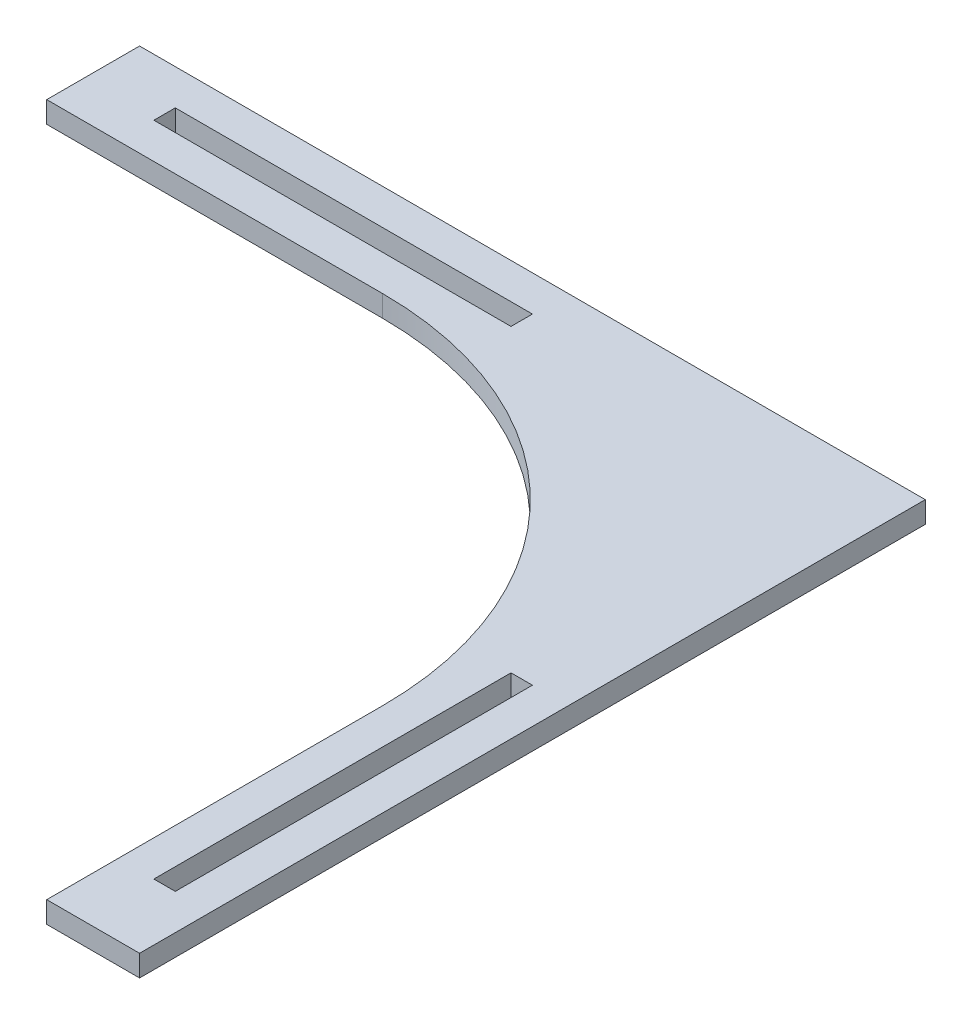
ISO-10303-21;
HEADER;
FILE_DESCRIPTION(('STEP AP214'),'2;1');
FILE_NAME('part.step','',(''),(''),'','','');
FILE_SCHEMA(('AUTOMOTIVE_DESIGN { 1 0 10303 214 1 1 1 1 }'));
ENDSEC;
DATA;
#1=APPLICATION_CONTEXT('core data for automotive mechanical design processes');
#2=APPLICATION_PROTOCOL_DEFINITION('international standard','automotive_design',2000,#1);
#3=PRODUCT_CONTEXT('',#1,'mechanical');
#4=PRODUCT('Part','Part','',(#3));
#5=PRODUCT_RELATED_PRODUCT_CATEGORY('part','',(#4));
#6=PRODUCT_DEFINITION_FORMATION('','',#4);
#7=PRODUCT_DEFINITION_CONTEXT('part definition',#1,'design');
#8=PRODUCT_DEFINITION('design','',#6,#7);
#9=PRODUCT_DEFINITION_SHAPE('','',#8);
#10=(LENGTH_UNIT() NAMED_UNIT(*) SI_UNIT(.MILLI.,.METRE.));
#11=(NAMED_UNIT(*) PLANE_ANGLE_UNIT() SI_UNIT($,.RADIAN.));
#12=(NAMED_UNIT(*) SI_UNIT($,.STERADIAN.) SOLID_ANGLE_UNIT());
#13=UNCERTAINTY_MEASURE_WITH_UNIT(LENGTH_MEASURE(1.E-05),#10,'distance_accuracy_value','');
#14=(GEOMETRIC_REPRESENTATION_CONTEXT(3) GLOBAL_UNCERTAINTY_ASSIGNED_CONTEXT((#13)) GLOBAL_UNIT_ASSIGNED_CONTEXT((#10,
#11,#12)) REPRESENTATION_CONTEXT('',''));
#15=CARTESIAN_POINT('',(0.,0.,0.));
#16=DIRECTION('',(0.,0.,1.));
#17=DIRECTION('',(1.,0.,0.));
#18=AXIS2_PLACEMENT_3D('',#15,#16,#17);
#19=CARTESIAN_POINT('',(-7.99999999999999,3.,8.00000000000001));
#20=DIRECTION('',(0.,-1.,0.));
#21=DIRECTION('',(0.,0.,-1.));
#22=AXIS2_PLACEMENT_3D('',#19,#20,#21);
#23=PLANE('',#22);
#24=DIRECTION('',(0.,0.,1.));
#25=VECTOR('',#24,1.);
#26=CARTESIAN_POINT('',(-45.,3.,-50.));
#27=LINE('',#26,#25);
#28=CARTESIAN_POINT('',(-45.,3.,-50.));
#29=VERTEX_POINT('',#28);
#30=CARTESIAN_POINT('',(-45.,3.,-47.));
#31=VERTEX_POINT('',#30);
#32=EDGE_CURVE('E176',#29,#31,#27,.T.);
#33=ORIENTED_EDGE('',*,*,#32,.F.);
#34=DIRECTION('',(-1.,0.,0.));
#35=VECTOR('',#34,1.);
#36=CARTESIAN_POINT('',(5.00000000000001,3.,-50.));
#37=LINE('',#36,#35);
#38=CARTESIAN_POINT('',(5.00000000000001,3.,-50.));
#39=VERTEX_POINT('',#38);
#40=EDGE_CURVE('E184',#39,#29,#37,.T.);
#41=ORIENTED_EDGE('',*,*,#40,.F.);
#42=DIRECTION('',(0.,0.,-1.));
#43=VECTOR('',#42,1.);
#44=CARTESIAN_POINT('',(5.00000000000001,3.,-47.));
#45=LINE('',#44,#43);
#46=CARTESIAN_POINT('',(5.00000000000001,3.,-47.));
#47=VERTEX_POINT('',#46);
#48=EDGE_CURVE('E181',#47,#39,#45,.T.);
#49=ORIENTED_EDGE('',*,*,#48,.F.);
#50=DIRECTION('',(1.,0.,0.));
#51=VECTOR('',#50,1.);
#52=CARTESIAN_POINT('',(-45.,3.,-47.));
#53=LINE('',#52,#51);
#54=EDGE_CURVE('E178',#31,#47,#53,.T.);
#55=ORIENTED_EDGE('',*,*,#54,.F.);
#56=EDGE_LOOP('',(#33,#41,#49,#55));
#57=FACE_BOUND('',#56,.T.);
#58=DIRECTION('',(0.,0.,-1.));
#59=VECTOR('',#58,1.);
#60=CARTESIAN_POINT('',(55.,3.,-55.));
#61=LINE('',#60,#59);
#62=CARTESIAN_POINT('',(55.,3.,55.));
#63=VERTEX_POINT('',#62);
#64=CARTESIAN_POINT('',(55.,3.,-55.));
#65=VERTEX_POINT('',#64);
#66=EDGE_CURVE('E207',#63,#65,#61,.T.);
#67=ORIENTED_EDGE('',*,*,#66,.T.);
#68=DIRECTION('',(-1.,0.,0.));
#69=VECTOR('',#68,1.);
#70=CARTESIAN_POINT('',(-55.,3.,-55.));
#71=LINE('',#70,#69);
#72=CARTESIAN_POINT('',(-55.,3.,-55.));
#73=VERTEX_POINT('',#72);
#74=EDGE_CURVE('E210',#65,#73,#71,.T.);
#75=ORIENTED_EDGE('',*,*,#74,.T.);
#76=DIRECTION('',(0.,0.,1.));
#77=VECTOR('',#76,1.);
#78=CARTESIAN_POINT('',(-55.,3.,-55.));
#79=LINE('',#78,#77);
#80=CARTESIAN_POINT('',(-55.,3.,-42.));
#81=VERTEX_POINT('',#80);
#82=EDGE_CURVE('E213',#73,#81,#79,.T.);
#83=ORIENTED_EDGE('',*,*,#82,.T.);
#84=DIRECTION('',(1.,0.,0.));
#85=VECTOR('',#84,1.);
#86=CARTESIAN_POINT('',(-55.,3.,-42.));
#87=LINE('',#86,#85);
#88=CARTESIAN_POINT('',(-8.00000000000034,3.,-42.));
#89=VERTEX_POINT('',#88);
#90=EDGE_CURVE('E215',#81,#89,#87,.T.);
#91=ORIENTED_EDGE('',*,*,#90,.T.);
#92=CARTESIAN_POINT('',(-7.99999999999999,3.,8.00000000000001));
#93=DIRECTION('',(0.,-1.,0.));
#94=DIRECTION('',(0.,0.,-1.));
#95=AXIS2_PLACEMENT_3D('',#92,#93,#94);
#96=CIRCLE('',#95,50.);
#97=CARTESIAN_POINT('',(42.,3.,8.00000000000035));
#98=VERTEX_POINT('',#97);
#99=EDGE_CURVE('E217',#89,#98,#96,.T.);
#100=ORIENTED_EDGE('',*,*,#99,.T.);
#101=DIRECTION('',(0.,0.,1.));
#102=VECTOR('',#101,1.);
#103=CARTESIAN_POINT('',(42.,3.,8.00000000000035));
#104=LINE('',#103,#102);
#105=CARTESIAN_POINT('',(42.,3.,55.));
#106=VERTEX_POINT('',#105);
#107=EDGE_CURVE('E219',#98,#106,#104,.T.);
#108=ORIENTED_EDGE('',*,*,#107,.T.);
#109=DIRECTION('',(1.,0.,0.));
#110=VECTOR('',#109,1.);
#111=CARTESIAN_POINT('',(42.,3.,55.));
#112=LINE('',#111,#110);
#113=EDGE_CURVE('E221',#106,#63,#112,.T.);
#114=ORIENTED_EDGE('',*,*,#113,.T.);
#115=EDGE_LOOP('',(#67,#75,#83,#91,#100,#108,#114));
#116=FACE_BOUND('',#115,.T.);
#117=DIRECTION('',(0.,0.,-1.));
#118=VECTOR('',#117,1.);
#119=CARTESIAN_POINT('',(50.,3.,45.));
#120=LINE('',#119,#118);
#121=CARTESIAN_POINT('',(50.,3.,45.));
#122=VERTEX_POINT('',#121);
#123=CARTESIAN_POINT('',(50.,3.,-4.99999999999998));
#124=VERTEX_POINT('',#123);
#125=EDGE_CURVE('E140',#122,#124,#120,.T.);
#126=ORIENTED_EDGE('',*,*,#125,.F.);
#127=DIRECTION('',(1.,0.,0.));
#128=VECTOR('',#127,1.);
#129=CARTESIAN_POINT('',(47.,3.,45.));
#130=LINE('',#129,#128);
#131=CARTESIAN_POINT('',(47.,3.,45.));
#132=VERTEX_POINT('',#131);
#133=EDGE_CURVE('E162',#132,#122,#130,.T.);
#134=ORIENTED_EDGE('',*,*,#133,.F.);
#135=DIRECTION('',(0.,0.,1.));
#136=VECTOR('',#135,1.);
#137=CARTESIAN_POINT('',(47.,3.,-4.99999999999998));
#138=LINE('',#137,#136);
#139=CARTESIAN_POINT('',(47.,3.,-4.99999999999998));
#140=VERTEX_POINT('',#139);
#141=EDGE_CURVE('E160',#140,#132,#138,.T.);
#142=ORIENTED_EDGE('',*,*,#141,.F.);
#143=DIRECTION('',(-1.,0.,0.));
#144=VECTOR('',#143,1.);
#145=CARTESIAN_POINT('',(50.,3.,-4.99999999999998));
#146=LINE('',#145,#144);
#147=EDGE_CURVE('E148',#124,#140,#146,.T.);
#148=ORIENTED_EDGE('',*,*,#147,.F.);
#149=EDGE_LOOP('',(#126,#134,#142,#148));
#150=FACE_BOUND('',#149,.T.);
#151=ADVANCED_FACE('F33',(#57,#116,#150),#23,.F.);
#152=CARTESIAN_POINT('',(-7.99999999999999,0.,8.00000000000001));
#153=DIRECTION('',(0.,-1.,0.));
#154=DIRECTION('',(0.,0.,-1.));
#155=AXIS2_PLACEMENT_3D('',#152,#153,#154);
#156=PLANE('',#155);
#157=DIRECTION('',(0.,0.,-1.));
#158=VECTOR('',#157,1.);
#159=CARTESIAN_POINT('',(55.,0.,-55.));
#160=LINE('',#159,#158);
#161=CARTESIAN_POINT('',(55.,0.,55.));
#162=VERTEX_POINT('',#161);
#163=CARTESIAN_POINT('',(55.,0.,-55.));
#164=VERTEX_POINT('',#163);
#165=EDGE_CURVE('E206',#162,#164,#160,.T.);
#166=ORIENTED_EDGE('',*,*,#165,.F.);
#167=DIRECTION('',(1.,0.,0.));
#168=VECTOR('',#167,1.);
#169=CARTESIAN_POINT('',(42.,0.,55.));
#170=LINE('',#169,#168);
#171=CARTESIAN_POINT('',(42.,0.,55.));
#172=VERTEX_POINT('',#171);
#173=EDGE_CURVE('E211',#172,#162,#170,.T.);
#174=ORIENTED_EDGE('',*,*,#173,.F.);
#175=DIRECTION('',(0.,0.,1.));
#176=VECTOR('',#175,1.);
#177=CARTESIAN_POINT('',(42.,0.,8.00000000000035));
#178=LINE('',#177,#176);
#179=CARTESIAN_POINT('',(42.,0.,8.00000000000035));
#180=VERTEX_POINT('',#179);
#181=EDGE_CURVE('E234',#180,#172,#178,.T.);
#182=ORIENTED_EDGE('',*,*,#181,.F.);
#183=CARTESIAN_POINT('',(-7.99999999999999,0.,8.00000000000001));
#184=DIRECTION('',(0.,-1.,0.));
#185=DIRECTION('',(0.,0.,-1.));
#186=AXIS2_PLACEMENT_3D('',#183,#184,#185);
#187=CIRCLE('',#186,50.);
#188=CARTESIAN_POINT('',(-8.00000000000034,0.,-42.));
#189=VERTEX_POINT('',#188);
#190=EDGE_CURVE('E232',#189,#180,#187,.T.);
#191=ORIENTED_EDGE('',*,*,#190,.F.);
#192=DIRECTION('',(1.,0.,0.));
#193=VECTOR('',#192,1.);
#194=CARTESIAN_POINT('',(-55.,0.,-42.));
#195=LINE('',#194,#193);
#196=CARTESIAN_POINT('',(-55.,0.,-42.));
#197=VERTEX_POINT('',#196);
#198=EDGE_CURVE('E230',#197,#189,#195,.T.);
#199=ORIENTED_EDGE('',*,*,#198,.F.);
#200=DIRECTION('',(0.,0.,1.));
#201=VECTOR('',#200,1.);
#202=CARTESIAN_POINT('',(-55.,0.,-55.));
#203=LINE('',#202,#201);
#204=CARTESIAN_POINT('',(-55.,0.,-55.));
#205=VERTEX_POINT('',#204);
#206=EDGE_CURVE('E228',#205,#197,#203,.T.);
#207=ORIENTED_EDGE('',*,*,#206,.F.);
#208=DIRECTION('',(-1.,0.,0.));
#209=VECTOR('',#208,1.);
#210=CARTESIAN_POINT('',(-55.,0.,-55.));
#211=LINE('',#210,#209);
#212=EDGE_CURVE('E226',#164,#205,#211,.T.);
#213=ORIENTED_EDGE('',*,*,#212,.F.);
#214=EDGE_LOOP('',(#166,#174,#182,#191,#199,#207,#213));
#215=FACE_BOUND('',#214,.T.);
#216=DIRECTION('',(-1.,0.,0.));
#217=VECTOR('',#216,1.);
#218=CARTESIAN_POINT('',(5.00000000000001,0.,-50.));
#219=LINE('',#218,#217);
#220=CARTESIAN_POINT('',(5.00000000000001,0.,-50.));
#221=VERTEX_POINT('',#220);
#222=CARTESIAN_POINT('',(-45.,0.,-50.));
#223=VERTEX_POINT('',#222);
#224=EDGE_CURVE('E179',#221,#223,#219,.T.);
#225=ORIENTED_EDGE('',*,*,#224,.T.);
#226=DIRECTION('',(0.,0.,1.));
#227=VECTOR('',#226,1.);
#228=CARTESIAN_POINT('',(-45.,0.,-50.));
#229=LINE('',#228,#227);
#230=CARTESIAN_POINT('',(-45.,0.,-47.));
#231=VERTEX_POINT('',#230);
#232=EDGE_CURVE('E156',#223,#231,#229,.T.);
#233=ORIENTED_EDGE('',*,*,#232,.T.);
#234=DIRECTION('',(1.,0.,0.));
#235=VECTOR('',#234,1.);
#236=CARTESIAN_POINT('',(-45.,0.,-47.));
#237=LINE('',#236,#235);
#238=CARTESIAN_POINT('',(5.00000000000001,0.,-47.));
#239=VERTEX_POINT('',#238);
#240=EDGE_CURVE('E189',#231,#239,#237,.T.);
#241=ORIENTED_EDGE('',*,*,#240,.T.);
#242=DIRECTION('',(0.,0.,-1.));
#243=VECTOR('',#242,1.);
#244=CARTESIAN_POINT('',(5.00000000000001,0.,-47.));
#245=LINE('',#244,#243);
#246=EDGE_CURVE('E192',#239,#221,#245,.T.);
#247=ORIENTED_EDGE('',*,*,#246,.T.);
#248=EDGE_LOOP('',(#225,#233,#241,#247));
#249=FACE_BOUND('',#248,.T.);
#250=DIRECTION('',(1.,0.,0.));
#251=VECTOR('',#250,1.);
#252=CARTESIAN_POINT('',(47.,0.,45.));
#253=LINE('',#252,#251);
#254=CARTESIAN_POINT('',(47.,0.,45.));
#255=VERTEX_POINT('',#254);
#256=CARTESIAN_POINT('',(50.,0.,45.));
#257=VERTEX_POINT('',#256);
#258=EDGE_CURVE('E149',#255,#257,#253,.T.);
#259=ORIENTED_EDGE('',*,*,#258,.T.);
#260=DIRECTION('',(0.,0.,-1.));
#261=VECTOR('',#260,1.);
#262=CARTESIAN_POINT('',(50.,0.,45.));
#263=LINE('',#262,#261);
#264=CARTESIAN_POINT('',(50.,0.,-4.99999999999998));
#265=VERTEX_POINT('',#264);
#266=EDGE_CURVE('E56',#257,#265,#263,.T.);
#267=ORIENTED_EDGE('',*,*,#266,.T.);
#268=DIRECTION('',(-1.,0.,0.));
#269=VECTOR('',#268,1.);
#270=CARTESIAN_POINT('',(50.,0.,-4.99999999999998));
#271=LINE('',#270,#269);
#272=CARTESIAN_POINT('',(47.,0.,-4.99999999999998));
#273=VERTEX_POINT('',#272);
#274=EDGE_CURVE('E155',#265,#273,#271,.T.);
#275=ORIENTED_EDGE('',*,*,#274,.T.);
#276=DIRECTION('',(0.,0.,1.));
#277=VECTOR('',#276,1.);
#278=CARTESIAN_POINT('',(47.,0.,-4.99999999999998));
#279=LINE('',#278,#277);
#280=EDGE_CURVE('E168',#273,#255,#279,.T.);
#281=ORIENTED_EDGE('',*,*,#280,.T.);
#282=EDGE_LOOP('',(#259,#267,#275,#281));
#283=FACE_BOUND('',#282,.T.);
#284=ADVANCED_FACE('F261',(#215,#249,#283),#156,.T.);
#285=CARTESIAN_POINT('',(55.,3.,-55.));
#286=DIRECTION('',(-1.,0.,0.));
#287=DIRECTION('',(0.,0.,1.));
#288=AXIS2_PLACEMENT_3D('',#285,#286,#287);
#289=PLANE('',#288);
#290=ORIENTED_EDGE('',*,*,#165,.T.);
#291=DIRECTION('',(0.,-1.,0.));
#292=VECTOR('',#291,1.);
#293=CARTESIAN_POINT('',(55.,3.,-55.));
#294=LINE('',#293,#292);
#295=EDGE_CURVE('E11',#65,#164,#294,.T.);
#296=ORIENTED_EDGE('',*,*,#295,.F.);
#297=ORIENTED_EDGE('',*,*,#66,.F.);
#298=DIRECTION('',(0.,-1.,0.));
#299=VECTOR('',#298,1.);
#300=CARTESIAN_POINT('',(55.,3.,55.));
#301=LINE('',#300,#299);
#302=EDGE_CURVE('E223',#63,#162,#301,.T.);
#303=ORIENTED_EDGE('',*,*,#302,.T.);
#304=EDGE_LOOP('',(#290,#296,#297,#303));
#305=FACE_BOUND('',#304,.T.);
#306=ADVANCED_FACE('F35',(#305),#289,.F.);
#307=CARTESIAN_POINT('',(-55.,3.,-55.));
#308=DIRECTION('',(0.,0.,1.));
#309=DIRECTION('',(1.,0.,0.));
#310=AXIS2_PLACEMENT_3D('',#307,#308,#309);
#311=PLANE('',#310);
#312=ORIENTED_EDGE('',*,*,#212,.T.);
#313=DIRECTION('',(0.,-1.,0.));
#314=VECTOR('',#313,1.);
#315=CARTESIAN_POINT('',(-55.,3.,-55.));
#316=LINE('',#315,#314);
#317=EDGE_CURVE('E41',#73,#205,#316,.T.);
#318=ORIENTED_EDGE('',*,*,#317,.F.);
#319=ORIENTED_EDGE('',*,*,#74,.F.);
#320=ORIENTED_EDGE('',*,*,#295,.T.);
#321=EDGE_LOOP('',(#312,#318,#319,#320));
#322=FACE_BOUND('',#321,.T.);
#323=ADVANCED_FACE('F278',(#322),#311,.F.);
#324=CARTESIAN_POINT('',(-55.,3.,-55.));
#325=DIRECTION('',(1.,0.,0.));
#326=DIRECTION('',(0.,0.,-1.));
#327=AXIS2_PLACEMENT_3D('',#324,#325,#326);
#328=PLANE('',#327);
#329=ORIENTED_EDGE('',*,*,#206,.T.);
#330=DIRECTION('',(0.,-1.,0.));
#331=VECTOR('',#330,1.);
#332=CARTESIAN_POINT('',(-55.,3.,-42.));
#333=LINE('',#332,#331);
#334=EDGE_CURVE('E248',#81,#197,#333,.T.);
#335=ORIENTED_EDGE('',*,*,#334,.F.);
#336=ORIENTED_EDGE('',*,*,#82,.F.);
#337=ORIENTED_EDGE('',*,*,#317,.T.);
#338=EDGE_LOOP('',(#329,#335,#336,#337));
#339=FACE_BOUND('',#338,.T.);
#340=ADVANCED_FACE('F255',(#339),#328,.F.);
#341=CARTESIAN_POINT('',(-55.,3.,-42.));
#342=DIRECTION('',(0.,0.,-1.));
#343=DIRECTION('',(-1.,0.,0.));
#344=AXIS2_PLACEMENT_3D('',#341,#342,#343);
#345=PLANE('',#344);
#346=ORIENTED_EDGE('',*,*,#198,.T.);
#347=DIRECTION('',(0.,-1.,0.));
#348=VECTOR('',#347,1.);
#349=CARTESIAN_POINT('',(-8.00000000000034,3.,-42.));
#350=LINE('',#349,#348);
#351=EDGE_CURVE('E245',#89,#189,#350,.T.);
#352=ORIENTED_EDGE('',*,*,#351,.F.);
#353=ORIENTED_EDGE('',*,*,#90,.F.);
#354=ORIENTED_EDGE('',*,*,#334,.T.);
#355=EDGE_LOOP('',(#346,#352,#353,#354));
#356=FACE_BOUND('',#355,.T.);
#357=ADVANCED_FACE('F267',(#356),#345,.F.);
#358=CARTESIAN_POINT('',(-7.99999999999999,3.,8.00000000000001));
#359=DIRECTION('',(0.,-1.,0.));
#360=DIRECTION('',(0.,0.,-1.));
#361=AXIS2_PLACEMENT_3D('',#358,#359,#360);
#362=CYLINDRICAL_SURFACE('',#361,50.);
#363=ORIENTED_EDGE('',*,*,#190,.T.);
#364=DIRECTION('',(0.,-1.,0.));
#365=VECTOR('',#364,1.);
#366=CARTESIAN_POINT('',(42.,3.,8.00000000000035));
#367=LINE('',#366,#365);
#368=EDGE_CURVE('E242',#98,#180,#367,.T.);
#369=ORIENTED_EDGE('',*,*,#368,.F.);
#370=ORIENTED_EDGE('',*,*,#99,.F.);
#371=ORIENTED_EDGE('',*,*,#351,.T.);
#372=EDGE_LOOP('',(#363,#369,#370,#371));
#373=FACE_BOUND('',#372,.T.);
#374=ADVANCED_FACE('F271',(#373),#362,.F.);
#375=CARTESIAN_POINT('',(42.,3.,8.00000000000035));
#376=DIRECTION('',(1.,0.,0.));
#377=DIRECTION('',(0.,0.,-1.));
#378=AXIS2_PLACEMENT_3D('',#375,#376,#377);
#379=PLANE('',#378);
#380=ORIENTED_EDGE('',*,*,#181,.T.);
#381=DIRECTION('',(0.,-1.,0.));
#382=VECTOR('',#381,1.);
#383=CARTESIAN_POINT('',(42.,3.,55.));
#384=LINE('',#383,#382);
#385=EDGE_CURVE('E239',#106,#172,#384,.T.);
#386=ORIENTED_EDGE('',*,*,#385,.F.);
#387=ORIENTED_EDGE('',*,*,#107,.F.);
#388=ORIENTED_EDGE('',*,*,#368,.T.);
#389=EDGE_LOOP('',(#380,#386,#387,#388));
#390=FACE_BOUND('',#389,.T.);
#391=ADVANCED_FACE('F286',(#390),#379,.F.);
#392=CARTESIAN_POINT('',(42.,3.,55.));
#393=DIRECTION('',(0.,0.,-1.));
#394=DIRECTION('',(-1.,0.,0.));
#395=AXIS2_PLACEMENT_3D('',#392,#393,#394);
#396=PLANE('',#395);
#397=ORIENTED_EDGE('',*,*,#173,.T.);
#398=ORIENTED_EDGE('',*,*,#302,.F.);
#399=ORIENTED_EDGE('',*,*,#113,.F.);
#400=ORIENTED_EDGE('',*,*,#385,.T.);
#401=EDGE_LOOP('',(#397,#398,#399,#400));
#402=FACE_BOUND('',#401,.T.);
#403=ADVANCED_FACE('F283',(#402),#396,.F.);
#404=CARTESIAN_POINT('',(-45.,3.,-50.));
#405=DIRECTION('',(1.,0.,0.));
#406=DIRECTION('',(0.,0.,-1.));
#407=AXIS2_PLACEMENT_3D('',#404,#405,#406);
#408=PLANE('',#407);
#409=ORIENTED_EDGE('',*,*,#232,.F.);
#410=DIRECTION('',(0.,-1.,0.));
#411=VECTOR('',#410,1.);
#412=CARTESIAN_POINT('',(-45.,3.,-50.));
#413=LINE('',#412,#411);
#414=EDGE_CURVE('E186',#29,#223,#413,.T.);
#415=ORIENTED_EDGE('',*,*,#414,.F.);
#416=ORIENTED_EDGE('',*,*,#32,.T.);
#417=DIRECTION('',(0.,-1.,0.));
#418=VECTOR('',#417,1.);
#419=CARTESIAN_POINT('',(-45.,3.,-47.));
#420=LINE('',#419,#418);
#421=EDGE_CURVE('E203',#31,#231,#420,.T.);
#422=ORIENTED_EDGE('',*,*,#421,.T.);
#423=EDGE_LOOP('',(#409,#415,#416,#422));
#424=FACE_BOUND('',#423,.T.);
#425=ADVANCED_FACE('F293',(#424),#408,.T.);
#426=CARTESIAN_POINT('',(-45.,3.,-47.));
#427=DIRECTION('',(0.,0.,-1.));
#428=DIRECTION('',(-1.,0.,0.));
#429=AXIS2_PLACEMENT_3D('',#426,#427,#428);
#430=PLANE('',#429);
#431=ORIENTED_EDGE('',*,*,#240,.F.);
#432=ORIENTED_EDGE('',*,*,#421,.F.);
#433=ORIENTED_EDGE('',*,*,#54,.T.);
#434=DIRECTION('',(0.,-1.,0.));
#435=VECTOR('',#434,1.);
#436=CARTESIAN_POINT('',(5.00000000000001,3.,-47.));
#437=LINE('',#436,#435);
#438=EDGE_CURVE('E201',#47,#239,#437,.T.);
#439=ORIENTED_EDGE('',*,*,#438,.T.);
#440=EDGE_LOOP('',(#431,#432,#433,#439));
#441=FACE_BOUND('',#440,.T.);
#442=ADVANCED_FACE('F307',(#441),#430,.T.);
#443=CARTESIAN_POINT('',(5.00000000000001,3.,-47.));
#444=DIRECTION('',(-1.,0.,0.));
#445=DIRECTION('',(0.,0.,1.));
#446=AXIS2_PLACEMENT_3D('',#443,#444,#445);
#447=PLANE('',#446);
#448=ORIENTED_EDGE('',*,*,#246,.F.);
#449=ORIENTED_EDGE('',*,*,#438,.F.);
#450=ORIENTED_EDGE('',*,*,#48,.T.);
#451=DIRECTION('',(0.,-1.,0.));
#452=VECTOR('',#451,1.);
#453=CARTESIAN_POINT('',(5.00000000000001,3.,-50.));
#454=LINE('',#453,#452);
#455=EDGE_CURVE('E199',#39,#221,#454,.T.);
#456=ORIENTED_EDGE('',*,*,#455,.T.);
#457=EDGE_LOOP('',(#448,#449,#450,#456));
#458=FACE_BOUND('',#457,.T.);
#459=ADVANCED_FACE('F311',(#458),#447,.T.);
#460=CARTESIAN_POINT('',(5.00000000000001,3.,-50.));
#461=DIRECTION('',(0.,0.,1.));
#462=DIRECTION('',(1.,0.,0.));
#463=AXIS2_PLACEMENT_3D('',#460,#461,#462);
#464=PLANE('',#463);
#465=ORIENTED_EDGE('',*,*,#224,.F.);
#466=ORIENTED_EDGE('',*,*,#455,.F.);
#467=ORIENTED_EDGE('',*,*,#40,.T.);
#468=ORIENTED_EDGE('',*,*,#414,.T.);
#469=EDGE_LOOP('',(#465,#466,#467,#468));
#470=FACE_BOUND('',#469,.T.);
#471=ADVANCED_FACE('F315',(#470),#464,.T.);
#472=CARTESIAN_POINT('',(50.,3.,45.));
#473=DIRECTION('',(-1.,0.,0.));
#474=DIRECTION('',(0.,0.,1.));
#475=AXIS2_PLACEMENT_3D('',#472,#473,#474);
#476=PLANE('',#475);
#477=ORIENTED_EDGE('',*,*,#266,.F.);
#478=DIRECTION('',(0.,-1.,0.));
#479=VECTOR('',#478,1.);
#480=CARTESIAN_POINT('',(50.,3.,45.));
#481=LINE('',#480,#479);
#482=EDGE_CURVE('E144',#122,#257,#481,.T.);
#483=ORIENTED_EDGE('',*,*,#482,.F.);
#484=ORIENTED_EDGE('',*,*,#125,.T.);
#485=DIRECTION('',(0.,-1.,0.));
#486=VECTOR('',#485,1.);
#487=CARTESIAN_POINT('',(50.,3.,-4.99999999999998));
#488=LINE('',#487,#486);
#489=EDGE_CURVE('E143',#124,#265,#488,.T.);
#490=ORIENTED_EDGE('',*,*,#489,.T.);
#491=EDGE_LOOP('',(#477,#483,#484,#490));
#492=FACE_BOUND('',#491,.T.);
#493=ADVANCED_FACE('F142',(#492),#476,.T.);
#494=CARTESIAN_POINT('',(50.,3.,-4.99999999999998));
#495=DIRECTION('',(0.,0.,1.));
#496=DIRECTION('',(1.,0.,0.));
#497=AXIS2_PLACEMENT_3D('',#494,#495,#496);
#498=PLANE('',#497);
#499=ORIENTED_EDGE('',*,*,#274,.F.);
#500=ORIENTED_EDGE('',*,*,#489,.F.);
#501=ORIENTED_EDGE('',*,*,#147,.T.);
#502=DIRECTION('',(0.,-1.,0.));
#503=VECTOR('',#502,1.);
#504=CARTESIAN_POINT('',(47.,3.,-4.99999999999998));
#505=LINE('',#504,#503);
#506=EDGE_CURVE('E157',#140,#273,#505,.T.);
#507=ORIENTED_EDGE('',*,*,#506,.T.);
#508=EDGE_LOOP('',(#499,#500,#501,#507));
#509=FACE_BOUND('',#508,.T.);
#510=ADVANCED_FACE('F152',(#509),#498,.T.);
#511=CARTESIAN_POINT('',(47.,3.,-4.99999999999998));
#512=DIRECTION('',(1.,0.,0.));
#513=DIRECTION('',(0.,0.,-1.));
#514=AXIS2_PLACEMENT_3D('',#511,#512,#513);
#515=PLANE('',#514);
#516=ORIENTED_EDGE('',*,*,#280,.F.);
#517=ORIENTED_EDGE('',*,*,#506,.F.);
#518=ORIENTED_EDGE('',*,*,#141,.T.);
#519=DIRECTION('',(0.,-1.,0.));
#520=VECTOR('',#519,1.);
#521=CARTESIAN_POINT('',(47.,3.,45.));
#522=LINE('',#521,#520);
#523=EDGE_CURVE('E48',#132,#255,#522,.T.);
#524=ORIENTED_EDGE('',*,*,#523,.T.);
#525=EDGE_LOOP('',(#516,#517,#518,#524));
#526=FACE_BOUND('',#525,.T.);
#527=ADVANCED_FACE('F324',(#526),#515,.T.);
#528=CARTESIAN_POINT('',(47.,3.,45.));
#529=DIRECTION('',(0.,0.,-1.));
#530=DIRECTION('',(-1.,0.,0.));
#531=AXIS2_PLACEMENT_3D('',#528,#529,#530);
#532=PLANE('',#531);
#533=ORIENTED_EDGE('',*,*,#258,.F.);
#534=ORIENTED_EDGE('',*,*,#523,.F.);
#535=ORIENTED_EDGE('',*,*,#133,.T.);
#536=ORIENTED_EDGE('',*,*,#482,.T.);
#537=EDGE_LOOP('',(#533,#534,#535,#536));
#538=FACE_BOUND('',#537,.T.);
#539=ADVANCED_FACE('F327',(#538),#532,.T.);
#540=CLOSED_SHELL('',(#151,#284,#306,#323,#340,#357,#374,#391,#403,#425,#442,#459,#471,#493,
#510,#527,#539));
#541=MANIFOLD_SOLID_BREP('B2',#540);
#542=ADVANCED_BREP_SHAPE_REPRESENTATION('',(#18,#541),#14);
#543=SHAPE_DEFINITION_REPRESENTATION(#9,#542);
ENDSEC;
END-ISO-10303-21;
